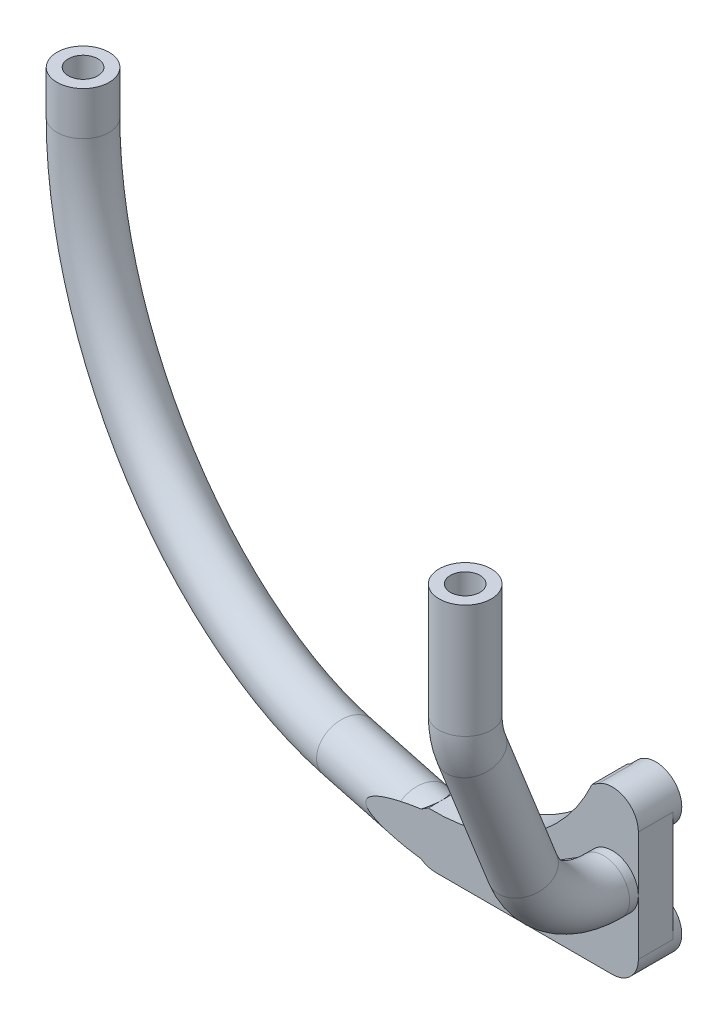
ISO-10303-21;
HEADER;
FILE_DESCRIPTION(('STEP AP214'),'2;1');
FILE_NAME('part.step','',(''),(''),'','','');
FILE_SCHEMA(('AUTOMOTIVE_DESIGN { 1 0 10303 214 1 1 1 1 }'));
ENDSEC;
DATA;
#1=APPLICATION_CONTEXT('core data for automotive mechanical design processes');
#2=APPLICATION_PROTOCOL_DEFINITION('international standard','automotive_design',2000,#1);
#3=PRODUCT_CONTEXT('',#1,'mechanical');
#4=PRODUCT('Part','Part','',(#3));
#5=PRODUCT_RELATED_PRODUCT_CATEGORY('part','',(#4));
#6=PRODUCT_DEFINITION_FORMATION('','',#4);
#7=PRODUCT_DEFINITION_CONTEXT('part definition',#1,'design');
#8=PRODUCT_DEFINITION('design','',#6,#7);
#9=PRODUCT_DEFINITION_SHAPE('','',#8);
#10=(LENGTH_UNIT() NAMED_UNIT(*) SI_UNIT(.MILLI.,.METRE.));
#11=(NAMED_UNIT(*) PLANE_ANGLE_UNIT() SI_UNIT($,.RADIAN.));
#12=(NAMED_UNIT(*) SI_UNIT($,.STERADIAN.) SOLID_ANGLE_UNIT());
#13=UNCERTAINTY_MEASURE_WITH_UNIT(LENGTH_MEASURE(1.E-05),#10,'distance_accuracy_value','');
#14=(GEOMETRIC_REPRESENTATION_CONTEXT(3) GLOBAL_UNCERTAINTY_ASSIGNED_CONTEXT((#13)) GLOBAL_UNIT_ASSIGNED_CONTEXT((#10,
#11,#12)) REPRESENTATION_CONTEXT('',''));
#15=CARTESIAN_POINT('',(0.,0.,0.));
#16=DIRECTION('',(0.,0.,1.));
#17=DIRECTION('',(1.,0.,0.));
#18=AXIS2_PLACEMENT_3D('',#15,#16,#17);
#19=CARTESIAN_POINT('',(0.,0.,1.));
#20=DIRECTION('',(0.,0.,1.));
#21=DIRECTION('',(1.,0.,0.));
#22=AXIS2_PLACEMENT_3D('',#19,#20,#21);
#23=PLANE('',#22);
#24=DIRECTION('',(0.847998304005092,0.529998940003174,0.));
#25=VECTOR('',#24,1.);
#26=CARTESIAN_POINT('',(-4.12999682000941,17.7839949120153,1.));
#27=LINE('',#26,#25);
#28=CARTESIAN_POINT('',(-24.4499968200095,5.08399491201543,1.));
#29=VERTEX_POINT('',#28);
#30=CARTESIAN_POINT('',(-23.7079590540112,5.54776851576436,1.));
#31=VERTEX_POINT('',#30);
#32=EDGE_CURVE('E297',#29,#31,#27,.T.);
#33=ORIENTED_EDGE('',*,*,#32,.T.);
#34=CARTESIAN_POINT('',(-23.105431544053,25.5386904704853,1.));
#35=DIRECTION('',(0.,0.,-1.));
#36=DIRECTION('',(-1.,0.,0.));
#37=AXIS2_PLACEMENT_3D('',#34,#35,#36);
#38=CIRCLE('',#37,20.);
#39=CARTESIAN_POINT('',(-22.8920128100939,5.53982919180257,1.));
#40=VERTEX_POINT('',#39);
#41=EDGE_CURVE('E56',#40,#31,#38,.T.);
#42=ORIENTED_EDGE('',*,*,#41,.F.);
#43=CARTESIAN_POINT('',(-22.86,2.54000000000016,1.));
#44=DIRECTION('',(0.,0.,1.));
#45=DIRECTION('',(1.,0.,0.));
#46=AXIS2_PLACEMENT_3D('',#43,#44,#45);
#47=CIRCLE('',#46,3.);
#48=EDGE_CURVE('E232',#29,#40,#47,.F.);
#49=ORIENTED_EDGE('',*,*,#48,.F.);
#50=EDGE_LOOP('',(#33,#42,#49));
#51=FACE_BOUND('',#50,.T.);
#52=ADVANCED_FACE('F41',(#51),#23,.F.);
#53=DIRECTION('',(-0.847998304005092,-0.529998940003174,0.));
#54=VECTOR('',#53,1.);
#55=CARTESIAN_POINT('',(-0.950003179990373,12.6960050879847,1.));
#56=LINE('',#55,#54);
#57=CARTESIAN_POINT('',(-5.53999999999989,9.82725707547884,1.));
#58=VERTEX_POINT('',#57);
#59=CARTESIAN_POINT('',(-12.3996113207659,5.54000000000016,1.));
#60=VERTEX_POINT('',#59);
#61=EDGE_CURVE('E199',#58,#60,#56,.T.);
#62=ORIENTED_EDGE('',*,*,#61,.T.);
#63=DIRECTION('',(-1.,0.,0.));
#64=VECTOR('',#63,1.);
#65=CARTESIAN_POINT('',(-22.86,5.54000000000016,1.));
#66=LINE('',#65,#64);
#67=CARTESIAN_POINT('',(-5.5399999999999,5.54000000000016,1.));
#68=VERTEX_POINT('',#67);
#69=EDGE_CURVE('E213',#68,#60,#66,.T.);
#70=ORIENTED_EDGE('',*,*,#69,.F.);
#71=DIRECTION('',(0.,-1.,0.));
#72=VECTOR('',#71,1.);
#73=CARTESIAN_POINT('',(-5.5399999999999,2.54000000000017,1.));
#74=LINE('',#73,#72);
#75=EDGE_CURVE('E256',#58,#68,#74,.T.);
#76=ORIENTED_EDGE('',*,*,#75,.F.);
#77=EDGE_LOOP('',(#62,#70,#76));
#78=FACE_BOUND('',#77,.T.);
#79=CARTESIAN_POINT('',(-22.86,-0.459999999999835,1.));
#80=VERTEX_POINT('',#79);
#81=EDGE_CURVE('E229',#40,#80,#47,.F.);
#82=ORIENTED_EDGE('',*,*,#81,.F.);
#83=CARTESIAN_POINT('',(-5.22244759270248,16.583307452672,1.));
#84=VERTEX_POINT('',#83);
#85=EDGE_CURVE('E355',#84,#40,#38,.T.);
#86=ORIENTED_EDGE('',*,*,#85,.F.);
#87=CARTESIAN_POINT('',(-2.53999999999989,15.24,1.));
#88=DIRECTION('',(0.,0.,1.));
#89=DIRECTION('',(1.,0.,0.));
#90=AXIS2_PLACEMENT_3D('',#87,#88,#89);
#91=CIRCLE('',#90,3.);
#92=CARTESIAN_POINT('',(0.460000000000107,15.24,1.));
#93=VERTEX_POINT('',#92);
#94=EDGE_CURVE('E275',#84,#93,#91,.T.);
#95=ORIENTED_EDGE('',*,*,#94,.T.);
#96=DIRECTION('',(0.,1.,0.));
#97=VECTOR('',#96,1.);
#98=CARTESIAN_POINT('',(0.460000000000105,2.54000000000016,1.));
#99=LINE('',#98,#97);
#100=CARTESIAN_POINT('',(0.460000000000107,2.54000000000016,1.));
#101=VERTEX_POINT('',#100);
#102=EDGE_CURVE('E258',#101,#93,#99,.T.);
#103=ORIENTED_EDGE('',*,*,#102,.F.);
#104=CARTESIAN_POINT('',(-2.53999999999989,2.54000000000016,1.));
#105=DIRECTION('',(0.,0.,1.));
#106=DIRECTION('',(1.,0.,0.));
#107=AXIS2_PLACEMENT_3D('',#104,#105,#106);
#108=CIRCLE('',#107,3.);
#109=CARTESIAN_POINT('',(-2.53999999999989,-0.459999999999836,1.));
#110=VERTEX_POINT('',#109);
#111=EDGE_CURVE('E281',#110,#101,#108,.F.);
#112=ORIENTED_EDGE('',*,*,#111,.F.);
#113=DIRECTION('',(1.,0.,0.));
#114=VECTOR('',#113,1.);
#115=CARTESIAN_POINT('',(-22.86,-0.459999999999836,1.));
#116=LINE('',#115,#114);
#117=EDGE_CURVE('E210',#80,#110,#116,.T.);
#118=ORIENTED_EDGE('',*,*,#117,.F.);
#119=EDGE_LOOP('',(#82,#86,#95,#103,#112,#118));
#120=FACE_BOUND('',#119,.T.);
#121=ADVANCED_FACE('F359',(#78,#120),#23,.F.);
#122=CARTESIAN_POINT('',(-4.12999682000941,17.7839949120153,-28.4730772580799));
#123=DIRECTION('',(-0.529998940003174,0.847998304005092,0.));
#124=DIRECTION('',(-0.847998304005092,-0.529998940003174,0.));
#125=AXIS2_PLACEMENT_3D('',#122,#123,#124);
#126=PLANE('',#125);
#127=DIRECTION('',(0.,0.,-1.));
#128=VECTOR('',#127,1.);
#129=CARTESIAN_POINT('',(-4.87203458600771,17.3202213082664,27.2170321925751));
#130=LINE('',#129,#128);
#131=CARTESIAN_POINT('',(-4.87203458600771,17.3202213082664,5.));
#132=VERTEX_POINT('',#131);
#133=CARTESIAN_POINT('',(-4.87203458600771,17.3202213082664,1.));
#134=VERTEX_POINT('',#133);
#135=EDGE_CURVE('E163',#132,#134,#130,.T.);
#136=ORIENTED_EDGE('',*,*,#135,.F.);
#137=DIRECTION('',(-0.847998304005092,-0.529998940003174,0.));
#138=VECTOR('',#137,1.);
#139=CARTESIAN_POINT('',(-4.12999682000941,17.7839949120153,5.));
#140=LINE('',#139,#138);
#141=CARTESIAN_POINT('',(-4.12999682000942,17.7839949120153,5.));
#142=VERTEX_POINT('',#141);
#143=EDGE_CURVE('E175',#142,#132,#140,.T.);
#144=ORIENTED_EDGE('',*,*,#143,.F.);
#145=DIRECTION('',(0.,0.,1.));
#146=VECTOR('',#145,1.);
#147=CARTESIAN_POINT('',(-4.12999682000941,17.7839949120153,-28.4730772580799));
#148=LINE('',#147,#146);
#149=CARTESIAN_POINT('',(-4.12999682000942,17.7839949120153,1.));
#150=VERTEX_POINT('',#149);
#151=EDGE_CURVE('E183',#150,#142,#148,.T.);
#152=ORIENTED_EDGE('',*,*,#151,.F.);
#153=EDGE_CURVE('E176',#134,#150,#27,.T.);
#154=ORIENTED_EDGE('',*,*,#153,.F.);
#155=EDGE_LOOP('',(#136,#144,#152,#154));
#156=FACE_BOUND('',#155,.T.);
#157=ADVANCED_FACE('F173',(#156),#126,.T.);
#158=CARTESIAN_POINT('',(-11.7875799398197,2.53999999999996,5.96526414957655));
#159=DIRECTION('',(-0.978512631178777,0.,-0.206186882763154));
#160=DIRECTION('',(-0.206186882763154,0.,0.978512631178777));
#161=AXIS2_PLACEMENT_3D('',#158,#159,#160);
#162=CYLINDRICAL_SURFACE('',#161,3.00000000000001);
#163=CARTESIAN_POINT('',(-26.4652694075013,2.53999999999994,2.87246090812925));
#164=DIRECTION('',(0.978512631178777,0.,0.206186882763154));
#165=DIRECTION('',(0.0425130306235854,0.978512631178777,-0.201756469167124));
#166=AXIS2_PLACEMENT_3D('',#163,#164,#165);
#167=CIRCLE('',#166,3.00000000000001);
#168=CARTESIAN_POINT('',(-26.9135729238097,0.472972818314274,5.));
#169=VERTEX_POINT('',#168);
#170=CARTESIAN_POINT('',(-26.9135729238097,4.60702718168562,5.));
#171=VERTEX_POINT('',#170);
#172=EDGE_CURVE('E321',#169,#171,#167,.T.);
#173=ORIENTED_EDGE('',*,*,#172,.T.);
#174=CARTESIAN_POINT('',(-16.3684880467125,2.53999999999995,5.));
#175=DIRECTION('',(0.,0.,-1.));
#176=DIRECTION('',(-1.,0.,0.));
#177=AXIS2_PLACEMENT_3D('',#174,#175,#176);
#178=ELLIPSE('',#177,14.5499071512037,3.00000000000001);
#179=CARTESIAN_POINT('',(-24.5461205553356,5.02132977914555,5.));
#180=VERTEX_POINT('',#179);
#181=EDGE_CURVE('E294',#171,#180,#178,.T.);
#182=ORIENTED_EDGE('',*,*,#181,.T.);
#183=CARTESIAN_POINT('',(-22.86,2.54000000000005,3.63214375428584));
#184=DIRECTION('',(-0.630005205231213,0.,-0.776590909927213));
#185=DIRECTION('',(0.776590909927213,0.,-0.630005205231213));
#186=AXIS2_PLACEMENT_3D('',#183,#184,#185);
#187=ELLIPSE('',#186,3.86303774825433,3.);
#188=CARTESIAN_POINT('',(-24.4499968200095,5.08399491201543,4.92202013591989));
#189=VERTEX_POINT('',#188);
#190=EDGE_CURVE('E64',#180,#189,#187,.T.);
#191=ORIENTED_EDGE('',*,*,#190,.T.);
#192=CARTESIAN_POINT('',(-28.5203886792344,2.53999999999994,2.43941730414976));
#193=DIRECTION('',(-0.529998940003174,0.847998304005092,0.));
#194=DIRECTION('',(-0.822971785263757,-0.51435736578984,-0.241151282222431));
#195=AXIS2_PLACEMENT_3D('',#192,#193,#194);
#196=ELLIPSE('',#195,5.78468636875458,3.00000000000001);
#197=CARTESIAN_POINT('',(-24.4499968200095,5.08399491201543,1.67219633324953));
#198=VERTEX_POINT('',#197);
#199=EDGE_CURVE('E49',#198,#189,#196,.F.);
#200=ORIENTED_EDGE('',*,*,#199,.F.);
#201=CARTESIAN_POINT('',(-22.86,2.54000000000005,3.63214375428584));
#202=DIRECTION('',(0.776590909927213,0.,-0.630005205231213));
#203=DIRECTION('',(-0.630005205231213,0.,-0.776590909927213));
#204=AXIS2_PLACEMENT_3D('',#201,#202,#203);
#205=ELLIPSE('',#204,4.76186541807856,3.);
#206=CARTESIAN_POINT('',(-25.8065571153319,3.10373856182361,0.));
#207=VERTEX_POINT('',#206);
#208=EDGE_CURVE('E309',#198,#207,#205,.F.);
#209=ORIENTED_EDGE('',*,*,#208,.T.);
#210=CARTESIAN_POINT('',(-40.0972679299312,2.53999999999993,0.));
#211=DIRECTION('',(0.,0.,1.));
#212=DIRECTION('',(-1.,0.,0.));
#213=AXIS2_PLACEMENT_3D('',#210,#211,#212);
#214=ELLIPSE('',#213,14.5499071512037,3.00000000000001);
#215=CARTESIAN_POINT('',(-25.8065571153319,1.97626143817644,0.));
#216=VERTEX_POINT('',#215);
#217=EDGE_CURVE('E305',#207,#216,#214,.F.);
#218=ORIENTED_EDGE('',*,*,#217,.T.);
#219=CARTESIAN_POINT('',(-22.86,-0.459999999999948,3.63214375428584));
#220=VERTEX_POINT('',#219);
#221=EDGE_CURVE('E307',#216,#220,#205,.F.);
#222=ORIENTED_EDGE('',*,*,#221,.T.);
#223=CARTESIAN_POINT('',(-24.5461205553356,0.0586702208543986,5.));
#224=VERTEX_POINT('',#223);
#225=EDGE_CURVE('E310',#220,#224,#187,.T.);
#226=ORIENTED_EDGE('',*,*,#225,.T.);
#227=EDGE_CURVE('E323',#224,#169,#178,.T.);
#228=ORIENTED_EDGE('',*,*,#227,.T.);
#229=EDGE_LOOP('',(#173,#182,#191,#200,#209,#218,#222,#226,#228));
#230=FACE_BOUND('',#229,.T.);
#231=ADVANCED_FACE('F386',(#230),#162,.T.);
#232=CARTESIAN_POINT('',(-22.86,2.54000000000016,5.));
#233=DIRECTION('',(0.,0.,-1.));
#234=DIRECTION('',(-1.,0.,0.));
#235=AXIS2_PLACEMENT_3D('',#232,#233,#234);
#236=CYLINDRICAL_SURFACE('',#235,3.);
#237=ORIENTED_EDGE('',*,*,#190,.F.);
#238=CARTESIAN_POINT('',(-22.86,2.54000000000016,5.));
#239=DIRECTION('',(0.,0.,1.));
#240=DIRECTION('',(1.,0.,0.));
#241=AXIS2_PLACEMENT_3D('',#238,#239,#240);
#242=CIRCLE('',#241,3.);
#243=CARTESIAN_POINT('',(-24.4499968200095,5.08399491201544,5.));
#244=VERTEX_POINT('',#243);
#245=EDGE_CURVE('E207',#244,#180,#242,.T.);
#246=ORIENTED_EDGE('',*,*,#245,.F.);
#247=DIRECTION('',(0.,0.,1.));
#248=VECTOR('',#247,1.);
#249=CARTESIAN_POINT('',(-24.4499968200095,5.08399491201543,-28.4730772580799));
#250=LINE('',#249,#248);
#251=EDGE_CURVE('E186',#189,#244,#250,.T.);
#252=ORIENTED_EDGE('',*,*,#251,.F.);
#253=EDGE_LOOP('',(#237,#246,#252));
#254=FACE_BOUND('',#253,.T.);
#255=ADVANCED_FACE('F292',(#254),#236,.T.);
#256=ORIENTED_EDGE('',*,*,#208,.F.);
#257=EDGE_CURVE('E192',#29,#198,#250,.T.);
#258=ORIENTED_EDGE('',*,*,#257,.F.);
#259=ORIENTED_EDGE('',*,*,#48,.T.);
#260=ORIENTED_EDGE('',*,*,#81,.T.);
#261=DIRECTION('',(0.,0.,1.));
#262=VECTOR('',#261,1.);
#263=CARTESIAN_POINT('',(-22.86,-0.459999999999836,1.));
#264=LINE('',#263,#262);
#265=EDGE_CURVE('E223',#80,#220,#264,.T.);
#266=ORIENTED_EDGE('',*,*,#265,.T.);
#267=ORIENTED_EDGE('',*,*,#221,.F.);
#268=CARTESIAN_POINT('',(-22.86,2.54000000000016,0.));
#269=DIRECTION('',(0.,0.,1.));
#270=DIRECTION('',(1.,0.,0.));
#271=AXIS2_PLACEMENT_3D('',#268,#269,#270);
#272=CIRCLE('',#271,3.);
#273=EDGE_CURVE('E203',#216,#207,#272,.T.);
#274=ORIENTED_EDGE('',*,*,#273,.T.);
#275=EDGE_LOOP('',(#256,#258,#259,#260,#266,#267,#274));
#276=FACE_BOUND('',#275,.T.);
#277=ADVANCED_FACE('F375',(#276),#236,.T.);
#278=ORIENTED_EDGE('',*,*,#225,.F.);
#279=CARTESIAN_POINT('',(-22.86,-0.459999999999836,5.));
#280=VERTEX_POINT('',#279);
#281=EDGE_CURVE('E216',#220,#280,#264,.T.);
#282=ORIENTED_EDGE('',*,*,#281,.T.);
#283=EDGE_CURVE('E202',#224,#280,#242,.T.);
#284=ORIENTED_EDGE('',*,*,#283,.F.);
#285=EDGE_LOOP('',(#278,#282,#284));
#286=FACE_BOUND('',#285,.T.);
#287=ADVANCED_FACE('F368',(#286),#236,.T.);
#288=EDGE_CURVE('E278',#150,#84,#91,.T.);
#289=ORIENTED_EDGE('',*,*,#288,.T.);
#290=EDGE_CURVE('E177',#134,#84,#38,.T.);
#291=ORIENTED_EDGE('',*,*,#290,.F.);
#292=ORIENTED_EDGE('',*,*,#153,.T.);
#293=EDGE_LOOP('',(#289,#291,#292));
#294=FACE_BOUND('',#293,.T.);
#295=ADVANCED_FACE('F366',(#294),#23,.F.);
#296=CARTESIAN_POINT('',(-2.53999999999989,15.24,5.));
#297=DIRECTION('',(0.,0.,-1.));
#298=DIRECTION('',(-1.,0.,0.));
#299=AXIS2_PLACEMENT_3D('',#296,#297,#298);
#300=CYLINDRICAL_SURFACE('',#299,3.);
#301=CARTESIAN_POINT('',(-2.53999999999989,15.24,0.));
#302=DIRECTION('',(0.,0.,1.));
#303=DIRECTION('',(1.,0.,0.));
#304=AXIS2_PLACEMENT_3D('',#301,#302,#303);
#305=CIRCLE('',#304,3.);
#306=CARTESIAN_POINT('',(0.460000000000107,15.24,0.));
#307=VERTEX_POINT('',#306);
#308=EDGE_CURVE('E262',#307,#307,#305,.T.);
#309=ORIENTED_EDGE('',*,*,#308,.T.);
#310=EDGE_LOOP('',(#309));
#311=FACE_BOUND('',#310,.T.);
#312=ORIENTED_EDGE('',*,*,#288,.F.);
#313=ORIENTED_EDGE('',*,*,#151,.T.);
#314=CARTESIAN_POINT('',(-2.53999999999989,15.24,5.));
#315=DIRECTION('',(0.,0.,1.));
#316=DIRECTION('',(1.,0.,0.));
#317=AXIS2_PLACEMENT_3D('',#314,#315,#316);
#318=CIRCLE('',#317,3.);
#319=CARTESIAN_POINT('',(0.460000000000107,15.24,5.));
#320=VERTEX_POINT('',#319);
#321=EDGE_CURVE('E182',#320,#142,#318,.T.);
#322=ORIENTED_EDGE('',*,*,#321,.F.);
#323=DIRECTION('',(0.,0.,1.));
#324=VECTOR('',#323,1.);
#325=CARTESIAN_POINT('',(0.460000000000107,15.24,-13.0459958707098));
#326=LINE('',#325,#324);
#327=EDGE_CURVE('E269',#93,#320,#326,.T.);
#328=ORIENTED_EDGE('',*,*,#327,.F.);
#329=ORIENTED_EDGE('',*,*,#94,.F.);
#330=EDGE_LOOP('',(#312,#313,#322,#328,#329));
#331=FACE_BOUND('',#330,.T.);
#332=ADVANCED_FACE('F43',(#311,#331),#300,.T.);
#333=CARTESIAN_POINT('',(-2.53999999999989,15.24,5.));
#334=DIRECTION('',(0.,0.,1.));
#335=DIRECTION('',(1.,0.,0.));
#336=AXIS2_PLACEMENT_3D('',#333,#334,#335);
#337=PLANE('',#336);
#338=CARTESIAN_POINT('',(-23.105431544053,25.5386904704853,5.));
#339=DIRECTION('',(0.,0.,1.));
#340=DIRECTION('',(1.,0.,0.));
#341=AXIS2_PLACEMENT_3D('',#338,#339,#340);
#342=CIRCLE('',#341,20.);
#343=CARTESIAN_POINT('',(-23.7079590540112,5.54776851576436,5.));
#344=VERTEX_POINT('',#343);
#345=EDGE_CURVE('E160',#132,#344,#342,.F.);
#346=ORIENTED_EDGE('',*,*,#345,.T.);
#347=EDGE_CURVE('E184',#344,#244,#140,.T.);
#348=ORIENTED_EDGE('',*,*,#347,.T.);
#349=ORIENTED_EDGE('',*,*,#245,.T.);
#350=ORIENTED_EDGE('',*,*,#181,.F.);
#351=CARTESIAN_POINT('',(-16.3684880467125,2.53999999999993,5.));
#352=DIRECTION('',(0.,0.,-1.));
#353=DIRECTION('',(-1.,0.,0.));
#354=AXIS2_PLACEMENT_3D('',#351,#352,#353);
#355=ELLIPSE('',#354,14.5499071512037,3.00000000000001);
#356=EDGE_CURVE('E12',#169,#171,#355,.T.);
#357=ORIENTED_EDGE('',*,*,#356,.F.);
#358=ORIENTED_EDGE('',*,*,#227,.F.);
#359=ORIENTED_EDGE('',*,*,#283,.T.);
#360=DIRECTION('',(1.,0.,0.));
#361=VECTOR('',#360,1.);
#362=CARTESIAN_POINT('',(-22.86,-0.459999999999836,5.));
#363=LINE('',#362,#361);
#364=CARTESIAN_POINT('',(-2.53999999999989,-0.459999999999836,5.));
#365=VERTEX_POINT('',#364);
#366=EDGE_CURVE('E206',#280,#365,#363,.T.);
#367=ORIENTED_EDGE('',*,*,#366,.T.);
#368=CARTESIAN_POINT('',(-2.53999999999989,2.54000000000016,5.));
#369=DIRECTION('',(0.,0.,1.));
#370=DIRECTION('',(-1.,0.,0.));
#371=AXIS2_PLACEMENT_3D('',#368,#369,#370);
#372=CIRCLE('',#371,3.);
#373=CARTESIAN_POINT('',(0.460000000000105,2.54000000000017,5.));
#374=VERTEX_POINT('',#373);
#375=EDGE_CURVE('E222',#365,#374,#372,.T.);
#376=ORIENTED_EDGE('',*,*,#375,.T.);
#377=DIRECTION('',(0.,-1.,0.));
#378=VECTOR('',#377,1.);
#379=CARTESIAN_POINT('',(0.460000000000105,2.54000000000016,5.));
#380=LINE('',#379,#378);
#381=CARTESIAN_POINT('',(0.460000000000108,8.89000000000009,5.));
#382=VERTEX_POINT('',#381);
#383=EDGE_CURVE('E255',#382,#374,#380,.T.);
#384=ORIENTED_EDGE('',*,*,#383,.F.);
#385=CARTESIAN_POINT('',(-2.53999999999989,8.89000000000009,5.));
#386=DIRECTION('',(0.,0.,1.));
#387=DIRECTION('',(1.,0.,0.));
#388=AXIS2_PLACEMENT_3D('',#385,#386,#387);
#389=CIRCLE('',#388,3.);
#390=CARTESIAN_POINT('',(-5.53999999999989,8.89000000000009,5.));
#391=VERTEX_POINT('',#390);
#392=EDGE_CURVE('E240',#391,#382,#389,.T.);
#393=ORIENTED_EDGE('',*,*,#392,.F.);
#394=DIRECTION('',(0.,1.,0.));
#395=VECTOR('',#394,1.);
#396=CARTESIAN_POINT('',(-5.5399999999999,2.54000000000017,5.));
#397=LINE('',#396,#395);
#398=CARTESIAN_POINT('',(-5.5399999999999,5.54000000000016,5.));
#399=VERTEX_POINT('',#398);
#400=EDGE_CURVE('E266',#399,#391,#397,.T.);
#401=ORIENTED_EDGE('',*,*,#400,.F.);
#402=DIRECTION('',(-1.,0.,0.));
#403=VECTOR('',#402,1.);
#404=CARTESIAN_POINT('',(-22.86,5.54000000000016,5.));
#405=LINE('',#404,#403);
#406=CARTESIAN_POINT('',(-12.3996113207659,5.54000000000016,5.));
#407=VERTEX_POINT('',#406);
#408=EDGE_CURVE('E214',#399,#407,#405,.T.);
#409=ORIENTED_EDGE('',*,*,#408,.T.);
#410=DIRECTION('',(0.847998304005092,0.529998940003174,0.));
#411=VECTOR('',#410,1.);
#412=CARTESIAN_POINT('',(-0.950003179990373,12.6960050879847,5.));
#413=LINE('',#412,#411);
#414=CARTESIAN_POINT('',(-5.53999999999989,9.82725707547884,5.));
#415=VERTEX_POINT('',#414);
#416=EDGE_CURVE('E188',#407,#415,#413,.T.);
#417=ORIENTED_EDGE('',*,*,#416,.T.);
#418=EDGE_CURVE('E265',#391,#415,#397,.T.);
#419=ORIENTED_EDGE('',*,*,#418,.F.);
#420=EDGE_CURVE('E237',#382,#391,#389,.T.);
#421=ORIENTED_EDGE('',*,*,#420,.F.);
#422=EDGE_CURVE('E263',#320,#382,#380,.T.);
#423=ORIENTED_EDGE('',*,*,#422,.F.);
#424=ORIENTED_EDGE('',*,*,#321,.T.);
#425=ORIENTED_EDGE('',*,*,#143,.T.);
#426=EDGE_LOOP('',(#346,#348,#349,#350,#357,#358,#359,#367,#376,#384,#393,#401,#409,#417,#419,
#421,#423,#424,#425));
#427=FACE_BOUND('',#426,.T.);
#428=ADVANCED_FACE('F180',(#427),#337,.T.);
#429=CARTESIAN_POINT('',(-2.53999999999989,15.24,0.));
#430=DIRECTION('',(0.,0.,1.));
#431=DIRECTION('',(1.,0.,0.));
#432=AXIS2_PLACEMENT_3D('',#429,#430,#431);
#433=PLANE('',#432);
#434=CARTESIAN_POINT('',(-2.53999999999989,15.24,0.));
#435=DIRECTION('',(0.,0.,-1.));
#436=DIRECTION('',(1.,0.,0.));
#437=AXIS2_PLACEMENT_3D('',#434,#435,#436);
#438=CIRCLE('',#437,1.7);
#439=CARTESIAN_POINT('',(-0.839999999999896,15.24,0.));
#440=VERTEX_POINT('',#439);
#441=EDGE_CURVE('E342',#440,#440,#438,.T.);
#442=ORIENTED_EDGE('',*,*,#441,.F.);
#443=EDGE_LOOP('',(#442));
#444=FACE_BOUND('',#443,.T.);
#445=ORIENTED_EDGE('',*,*,#308,.F.);
#446=EDGE_LOOP('',(#445));
#447=FACE_BOUND('',#446,.T.);
#448=ADVANCED_FACE('F566',(#444,#447),#433,.F.);
#449=CARTESIAN_POINT('',(-5.5399999999999,2.54000000000017,-13.0459958707098));
#450=DIRECTION('',(1.,0.,0.));
#451=DIRECTION('',(0.,1.,0.));
#452=AXIS2_PLACEMENT_3D('',#449,#450,#451);
#453=PLANE('',#452);
#454=ORIENTED_EDGE('',*,*,#418,.T.);
#455=DIRECTION('',(0.,0.,-1.));
#456=VECTOR('',#455,1.);
#457=CARTESIAN_POINT('',(-5.53999999999989,9.82725707547884,-13.0459958707098));
#458=LINE('',#457,#456);
#459=EDGE_CURVE('E198',#415,#58,#458,.T.);
#460=ORIENTED_EDGE('',*,*,#459,.T.);
#461=ORIENTED_EDGE('',*,*,#75,.T.);
#462=DIRECTION('',(0.,0.,1.));
#463=VECTOR('',#462,1.);
#464=CARTESIAN_POINT('',(-5.5399999999999,5.54000000000016,-13.0459958707098));
#465=LINE('',#464,#463);
#466=EDGE_CURVE('E235',#68,#399,#465,.T.);
#467=ORIENTED_EDGE('',*,*,#466,.T.);
#468=ORIENTED_EDGE('',*,*,#400,.T.);
#469=EDGE_LOOP('',(#454,#460,#461,#467,#468));
#470=FACE_BOUND('',#469,.T.);
#471=ADVANCED_FACE('F402',(#470),#453,.F.);
#472=CARTESIAN_POINT('',(0.460000000000105,2.54000000000016,-13.0459958707098));
#473=DIRECTION('',(-1.,0.,0.));
#474=DIRECTION('',(0.,-1.,0.));
#475=AXIS2_PLACEMENT_3D('',#472,#473,#474);
#476=PLANE('',#475);
#477=DIRECTION('',(0.,0.,1.));
#478=VECTOR('',#477,1.);
#479=CARTESIAN_POINT('',(0.460000000000105,2.54000000000017,-13.0459958707098));
#480=LINE('',#479,#478);
#481=EDGE_CURVE('E259',#101,#374,#480,.T.);
#482=ORIENTED_EDGE('',*,*,#481,.F.);
#483=ORIENTED_EDGE('',*,*,#102,.T.);
#484=ORIENTED_EDGE('',*,*,#327,.T.);
#485=ORIENTED_EDGE('',*,*,#422,.T.);
#486=ORIENTED_EDGE('',*,*,#383,.T.);
#487=EDGE_LOOP('',(#482,#483,#484,#485,#486));
#488=FACE_BOUND('',#487,.T.);
#489=ADVANCED_FACE('F489',(#488),#476,.F.);
#490=CARTESIAN_POINT('',(-2.53999999999989,46.9387395096274,21.9299999999999));
#491=DIRECTION('',(0.,1.,0.));
#492=DIRECTION('',(1.,0.,0.));
#493=AXIS2_PLACEMENT_3D('',#490,#491,#492);
#494=PLANE('',#493);
#495=CARTESIAN_POINT('',(-2.53999999999989,46.9387395096274,21.9300000000007));
#496=DIRECTION('',(0.,1.,0.));
#497=DIRECTION('',(0.,0.,1.));
#498=AXIS2_PLACEMENT_3D('',#495,#496,#497);
#499=CIRCLE('',#498,1.7);
#500=CARTESIAN_POINT('',(-2.53999999999989,46.9387395096274,23.6300000000007));
#501=VERTEX_POINT('',#500);
#502=EDGE_CURVE('E334',#501,#501,#499,.T.);
#503=ORIENTED_EDGE('',*,*,#502,.F.);
#504=EDGE_LOOP('',(#503));
#505=FACE_BOUND('',#504,.T.);
#506=CARTESIAN_POINT('',(-2.53999999999989,46.9387395096274,21.9299999999999));
#507=DIRECTION('',(0.,1.,0.));
#508=DIRECTION('',(1.,0.,0.));
#509=AXIS2_PLACEMENT_3D('',#506,#507,#508);
#510=CIRCLE('',#509,3.);
#511=CARTESIAN_POINT('',(0.460000000000108,46.9387395096274,21.9299999999999));
#512=VERTEX_POINT('',#511);
#513=EDGE_CURVE('E252',#512,#512,#510,.T.);
#514=ORIENTED_EDGE('',*,*,#513,.T.);
#515=EDGE_LOOP('',(#514));
#516=FACE_BOUND('',#515,.T.);
#517=ADVANCED_FACE('F467',(#505,#516),#494,.T.);
#518=CARTESIAN_POINT('',(-2.53999999999989,8.89000000000009,5.));
#519=DIRECTION('',(0.,0.,1.));
#520=DIRECTION('',(1.,0.,0.));
#521=AXIS2_PLACEMENT_3D('',#518,#519,#520);
#522=CYLINDRICAL_SURFACE('',#521,3.);
#523=CARTESIAN_POINT('',(-2.53999999999989,8.89000000000009,6.));
#524=DIRECTION('',(0.,0.,1.));
#525=DIRECTION('',(1.,0.,0.));
#526=AXIS2_PLACEMENT_3D('',#523,#524,#525);
#527=CIRCLE('',#526,3.);
#528=CARTESIAN_POINT('',(-2.53999999999989,5.89000000000009,6.));
#529=VERTEX_POINT('',#528);
#530=EDGE_CURVE('E239',#529,#529,#527,.T.);
#531=ORIENTED_EDGE('',*,*,#530,.F.);
#532=EDGE_LOOP('',(#531));
#533=FACE_BOUND('',#532,.T.);
#534=ORIENTED_EDGE('',*,*,#420,.T.);
#535=ORIENTED_EDGE('',*,*,#392,.T.);
#536=EDGE_LOOP('',(#534,#535));
#537=FACE_BOUND('',#536,.T.);
#538=ADVANCED_FACE('F471',(#533,#537),#522,.T.);
#539=CARTESIAN_POINT('',(-2.53999999999989,18.8900000000001,6.));
#540=DIRECTION('',(-1.,0.,0.));
#541=DIRECTION('',(0.,0.,1.));
#542=AXIS2_PLACEMENT_3D('',#539,#540,#541);
#543=TOROIDAL_SURFACE('',#542,9.99999999999999,3.);
#544=CARTESIAN_POINT('',(-2.53999999999989,15.2047368680218,15.2961731722296));
#545=DIRECTION('',(0.,0.929617317222961,0.368526313197829));
#546=DIRECTION('',(1.,0.,0.));
#547=AXIS2_PLACEMENT_3D('',#544,#545,#546);
#548=CIRCLE('',#547,3.);
#549=CARTESIAN_POINT('',(-2.53999999999989,14.0991579284283,18.0850251238985));
#550=VERTEX_POINT('',#549);
#551=EDGE_CURVE('E243',#550,#550,#548,.T.);
#552=CARTESIAN_POINT('',(-2.53999999999989,18.8900000000001,6.));
#553=DIRECTION('',(-1.,0.,0.));
#554=DIRECTION('',(0.,0.,1.));
#555=AXIS2_PLACEMENT_3D('',#552,#553,#554);
#556=CIRCLE('',#555,13.);
#557=EDGE_CURVE('',#529,#550,#556,.T.);
#558=ORIENTED_EDGE('',*,*,#530,.T.);
#559=ORIENTED_EDGE('',*,*,#551,.F.);
#560=ORIENTED_EDGE('',*,*,#557,.T.);
#561=ORIENTED_EDGE('',*,*,#557,.F.);
#562=EDGE_LOOP('',(#558,#560,#559,#561));
#563=FACE_BOUND('',#562,.T.);
#564=ADVANCED_FACE('F474',(#563),#543,.T.);
#565=CARTESIAN_POINT('',(-2.53999999999989,15.2047368680218,15.2961731722296));
#566=DIRECTION('',(0.,0.929617317222961,0.368526313197829));
#567=DIRECTION('',(0.,-0.368526313197829,0.929617317222961));
#568=AXIS2_PLACEMENT_3D('',#565,#566,#567);
#569=CYLINDRICAL_SURFACE('',#568,3.);
#570=CARTESIAN_POINT('',(-2.53999999999989,30.1633178260466,21.2261731722296));
#571=DIRECTION('',(0.,0.929617317222961,0.368526313197829));
#572=DIRECTION('',(1.,0.,0.));
#573=AXIS2_PLACEMENT_3D('',#570,#571,#572);
#574=CIRCLE('',#573,3.);
#575=CARTESIAN_POINT('',(-2.53999999999989,29.057738886453,24.0150251238984));
#576=VERTEX_POINT('',#575);
#577=EDGE_CURVE('E246',#576,#576,#574,.T.);
#578=ORIENTED_EDGE('',*,*,#577,.F.);
#579=EDGE_LOOP('',(#578));
#580=FACE_BOUND('',#579,.T.);
#581=ORIENTED_EDGE('',*,*,#551,.T.);
#582=EDGE_LOOP('',(#581));
#583=FACE_BOUND('',#582,.T.);
#584=ADVANCED_FACE('F478',(#580,#583),#569,.T.);
#585=CARTESIAN_POINT('',(-2.53999999999989,33.8485809580251,11.9299999999999));
#586=DIRECTION('',(-1.,0.,0.));
#587=DIRECTION('',(0.,0.,1.));
#588=AXIS2_PLACEMENT_3D('',#585,#586,#587);
#589=TOROIDAL_SURFACE('',#588,10.,3.);
#590=CARTESIAN_POINT('',(-2.53999999999989,33.8485809580249,21.93));
#591=DIRECTION('',(0.,1.,0.));
#592=DIRECTION('',(1.,0.,0.));
#593=AXIS2_PLACEMENT_3D('',#590,#591,#592);
#594=CIRCLE('',#593,3.);
#595=CARTESIAN_POINT('',(-2.53999999999989,33.8485809580248,24.93));
#596=VERTEX_POINT('',#595);
#597=EDGE_CURVE('E249',#596,#596,#594,.T.);
#598=CARTESIAN_POINT('',(-2.53999999999989,33.8485809580251,11.9299999999999));
#599=DIRECTION('',(-1.,0.,0.));
#600=DIRECTION('',(0.,0.,1.));
#601=AXIS2_PLACEMENT_3D('',#598,#599,#600);
#602=CIRCLE('',#601,13.);
#603=EDGE_CURVE('',#576,#596,#602,.T.);
#604=ORIENTED_EDGE('',*,*,#577,.T.);
#605=ORIENTED_EDGE('',*,*,#597,.F.);
#606=ORIENTED_EDGE('',*,*,#603,.T.);
#607=ORIENTED_EDGE('',*,*,#603,.F.);
#608=EDGE_LOOP('',(#604,#606,#605,#607));
#609=FACE_BOUND('',#608,.T.);
#610=ADVANCED_FACE('F482',(#609),#589,.T.);
#611=CARTESIAN_POINT('',(-2.53999999999989,33.8485809580249,21.9299999999999));
#612=DIRECTION('',(0.,1.,0.));
#613=DIRECTION('',(0.,0.,1.));
#614=AXIS2_PLACEMENT_3D('',#611,#612,#613);
#615=CYLINDRICAL_SURFACE('',#614,3.);
#616=ORIENTED_EDGE('',*,*,#513,.F.);
#617=EDGE_LOOP('',(#616));
#618=FACE_BOUND('',#617,.T.);
#619=ORIENTED_EDGE('',*,*,#597,.T.);
#620=EDGE_LOOP('',(#619));
#621=FACE_BOUND('',#620,.T.);
#622=ADVANCED_FACE('F465',(#618,#621),#615,.T.);
#623=CARTESIAN_POINT('',(-2.53999999999989,2.54000000000016,5.));
#624=DIRECTION('',(0.,0.,-1.));
#625=DIRECTION('',(-1.,0.,0.));
#626=AXIS2_PLACEMENT_3D('',#623,#624,#625);
#627=CYLINDRICAL_SURFACE('',#626,3.);
#628=CARTESIAN_POINT('',(-2.53999999999989,2.54000000000016,0.));
#629=DIRECTION('',(0.,0.,1.));
#630=DIRECTION('',(-1.,0.,0.));
#631=AXIS2_PLACEMENT_3D('',#628,#629,#630);
#632=CIRCLE('',#631,3.);
#633=CARTESIAN_POINT('',(-5.53999999999989,2.54000000000016,0.));
#634=VERTEX_POINT('',#633);
#635=EDGE_CURVE('E226',#634,#634,#632,.T.);
#636=ORIENTED_EDGE('',*,*,#635,.T.);
#637=EDGE_LOOP('',(#636));
#638=FACE_BOUND('',#637,.T.);
#639=ORIENTED_EDGE('',*,*,#111,.T.);
#640=ORIENTED_EDGE('',*,*,#481,.T.);
#641=ORIENTED_EDGE('',*,*,#375,.F.);
#642=DIRECTION('',(0.,0.,1.));
#643=VECTOR('',#642,1.);
#644=CARTESIAN_POINT('',(-2.53999999999989,-0.459999999999836,1.));
#645=LINE('',#644,#643);
#646=EDGE_CURVE('E219',#110,#365,#645,.T.);
#647=ORIENTED_EDGE('',*,*,#646,.F.);
#648=EDGE_LOOP('',(#639,#640,#641,#647));
#649=FACE_BOUND('',#648,.T.);
#650=ADVANCED_FACE('F425',(#638,#649),#627,.T.);
#651=CARTESIAN_POINT('',(-22.86,5.54000000000016,1.));
#652=DIRECTION('',(0.,1.,0.));
#653=DIRECTION('',(0.,0.,1.));
#654=AXIS2_PLACEMENT_3D('',#651,#652,#653);
#655=PLANE('',#654);
#656=DIRECTION('',(0.,0.,-1.));
#657=VECTOR('',#656,1.);
#658=CARTESIAN_POINT('',(-12.3996113207659,5.54000000000016,1.));
#659=LINE('',#658,#657);
#660=EDGE_CURVE('E195',#407,#60,#659,.T.);
#661=ORIENTED_EDGE('',*,*,#660,.F.);
#662=ORIENTED_EDGE('',*,*,#408,.F.);
#663=ORIENTED_EDGE('',*,*,#466,.F.);
#664=ORIENTED_EDGE('',*,*,#69,.T.);
#665=EDGE_LOOP('',(#661,#662,#663,#664));
#666=FACE_BOUND('',#665,.T.);
#667=ADVANCED_FACE('F397',(#666),#655,.T.);
#668=CARTESIAN_POINT('',(-2.53999999999989,2.54000000000016,0.));
#669=DIRECTION('',(0.,0.,-1.));
#670=DIRECTION('',(-1.,0.,0.));
#671=AXIS2_PLACEMENT_3D('',#668,#669,#670);
#672=PLANE('',#671);
#673=CARTESIAN_POINT('',(-2.53999999999989,2.54000000000017,0.));
#674=DIRECTION('',(0.,0.,-1.));
#675=DIRECTION('',(-1.,0.,0.));
#676=AXIS2_PLACEMENT_3D('',#673,#674,#675);
#677=CIRCLE('',#676,1.7);
#678=CARTESIAN_POINT('',(-4.23999999999989,2.54000000000017,0.));
#679=VERTEX_POINT('',#678);
#680=EDGE_CURVE('E339',#679,#679,#677,.T.);
#681=ORIENTED_EDGE('',*,*,#680,.F.);
#682=EDGE_LOOP('',(#681));
#683=FACE_BOUND('',#682,.T.);
#684=ORIENTED_EDGE('',*,*,#635,.F.);
#685=EDGE_LOOP('',(#684));
#686=FACE_BOUND('',#685,.T.);
#687=ADVANCED_FACE('F460',(#683,#686),#672,.T.);
#688=CARTESIAN_POINT('',(-22.86,-0.459999999999836,1.));
#689=DIRECTION('',(0.,-1.,0.));
#690=DIRECTION('',(0.,0.,-1.));
#691=AXIS2_PLACEMENT_3D('',#688,#689,#690);
#692=PLANE('',#691);
#693=ORIENTED_EDGE('',*,*,#646,.T.);
#694=ORIENTED_EDGE('',*,*,#366,.F.);
#695=ORIENTED_EDGE('',*,*,#281,.F.);
#696=ORIENTED_EDGE('',*,*,#265,.F.);
#697=ORIENTED_EDGE('',*,*,#117,.T.);
#698=EDGE_LOOP('',(#693,#694,#695,#696,#697));
#699=FACE_BOUND('',#698,.T.);
#700=ADVANCED_FACE('F421',(#699),#692,.T.);
#701=CARTESIAN_POINT('',(-22.86,2.54000000000016,0.));
#702=DIRECTION('',(0.,0.,1.));
#703=DIRECTION('',(1.,0.,0.));
#704=AXIS2_PLACEMENT_3D('',#701,#702,#703);
#705=PLANE('',#704);
#706=CARTESIAN_POINT('',(-22.86,2.54000000000017,0.));
#707=DIRECTION('',(0.,0.,-1.));
#708=DIRECTION('',(1.,0.,0.));
#709=AXIS2_PLACEMENT_3D('',#706,#707,#708);
#710=CIRCLE('',#709,1.7);
#711=CARTESIAN_POINT('',(-21.16,2.54000000000017,0.));
#712=VERTEX_POINT('',#711);
#713=EDGE_CURVE('E347',#712,#712,#710,.T.);
#714=ORIENTED_EDGE('',*,*,#713,.F.);
#715=EDGE_LOOP('',(#714));
#716=FACE_BOUND('',#715,.T.);
#717=ORIENTED_EDGE('',*,*,#217,.F.);
#718=ORIENTED_EDGE('',*,*,#273,.F.);
#719=EDGE_LOOP('',(#717,#718));
#720=FACE_BOUND('',#719,.T.);
#721=ADVANCED_FACE('F452',(#716,#720),#705,.F.);
#722=CARTESIAN_POINT('',(-0.950003179990373,12.6960050879847,-28.4730772580799));
#723=DIRECTION('',(0.529998940003174,-0.847998304005092,0.));
#724=DIRECTION('',(0.847998304005092,0.529998940003174,0.));
#725=AXIS2_PLACEMENT_3D('',#722,#723,#724);
#726=PLANE('',#725);
#727=ORIENTED_EDGE('',*,*,#459,.F.);
#728=ORIENTED_EDGE('',*,*,#416,.F.);
#729=ORIENTED_EDGE('',*,*,#660,.T.);
#730=ORIENTED_EDGE('',*,*,#61,.F.);
#731=EDGE_LOOP('',(#727,#728,#729,#730));
#732=FACE_BOUND('',#731,.T.);
#733=ADVANCED_FACE('F392',(#732),#726,.T.);
#734=DIRECTION('',(0.,0.,-1.));
#735=VECTOR('',#734,1.);
#736=CARTESIAN_POINT('',(-23.7079590540112,5.54776851576436,27.2170321925751));
#737=LINE('',#736,#735);
#738=EDGE_CURVE('E165',#344,#31,#737,.T.);
#739=ORIENTED_EDGE('',*,*,#738,.T.);
#740=ORIENTED_EDGE('',*,*,#32,.F.);
#741=ORIENTED_EDGE('',*,*,#257,.T.);
#742=ORIENTED_EDGE('',*,*,#199,.T.);
#743=ORIENTED_EDGE('',*,*,#251,.T.);
#744=ORIENTED_EDGE('',*,*,#347,.F.);
#745=EDGE_LOOP('',(#739,#740,#741,#742,#743,#744));
#746=FACE_BOUND('',#745,.T.);
#747=ADVANCED_FACE('F286',(#746),#126,.T.);
#748=CARTESIAN_POINT('',(-76.0226406731242,46.9387395096272,-7.56999999999998));
#749=DIRECTION('',(0.,-1.,0.));
#750=DIRECTION('',(1.,0.,0.));
#751=AXIS2_PLACEMENT_3D('',#748,#749,#750);
#752=PLANE('',#751);
#753=CARTESIAN_POINT('',(-76.0226406731242,46.9387395096274,-7.56999999999998));
#754=DIRECTION('',(0.,1.,0.));
#755=DIRECTION('',(0.,0.,-1.));
#756=AXIS2_PLACEMENT_3D('',#753,#754,#755);
#757=CIRCLE('',#756,1.70000000000001);
#758=CARTESIAN_POINT('',(-76.0226406731242,46.9387395096274,-9.26999999999999));
#759=VERTEX_POINT('',#758);
#760=EDGE_CURVE('E330',#759,#759,#757,.T.);
#761=ORIENTED_EDGE('',*,*,#760,.F.);
#762=EDGE_LOOP('',(#761));
#763=FACE_BOUND('',#762,.T.);
#764=CARTESIAN_POINT('',(-76.0226406731242,46.9387395096272,-7.56999999999998));
#765=DIRECTION('',(0.,-1.,0.));
#766=DIRECTION('',(1.,0.,0.));
#767=AXIS2_PLACEMENT_3D('',#764,#765,#766);
#768=CIRCLE('',#767,3.00000000000001);
#769=CARTESIAN_POINT('',(-73.0226406731242,46.9387395096272,-7.56999999999998));
#770=VERTEX_POINT('',#769);
#771=EDGE_CURVE('E312',#770,#770,#768,.T.);
#772=ORIENTED_EDGE('',*,*,#771,.F.);
#773=EDGE_LOOP('',(#772));
#774=FACE_BOUND('',#773,.T.);
#775=ADVANCED_FACE('F431',(#763,#774),#752,.F.);
#776=CARTESIAN_POINT('',(-26.4652694075013,2.53999999999994,2.87246090812925));
#777=DIRECTION('',(-0.978512631178777,0.,-0.206186882763153));
#778=DIRECTION('',(-0.206186882763153,0.,0.978512631178777));
#779=AXIS2_PLACEMENT_3D('',#776,#777,#778);
#780=CYLINDRICAL_SURFACE('',#779,3.00000000000001);
#781=CARTESIAN_POINT('',(-37.4704764104316,2.53999999999996,0.553503284287556));
#782=DIRECTION('',(0.978512631178777,0.,0.206186882763153));
#783=DIRECTION('',(0.0425130306235877,0.978512631178777,-0.201756469167123));
#784=AXIS2_PLACEMENT_3D('',#781,#782,#783);
#785=CIRCLE('',#784,3.00000000000001);
#786=CARTESIAN_POINT('',(-37.4704764104316,-0.460000000000065,0.553503284287556));
#787=VERTEX_POINT('',#786);
#788=EDGE_CURVE('E318',#787,#787,#785,.T.);
#789=ORIENTED_EDGE('',*,*,#788,.T.);
#790=EDGE_LOOP('',(#789));
#791=FACE_BOUND('',#790,.T.);
#792=ORIENTED_EDGE('',*,*,#356,.T.);
#793=ORIENTED_EDGE('',*,*,#172,.F.);
#794=EDGE_LOOP('',(#792,#793));
#795=FACE_BOUND('',#794,.T.);
#796=ADVANCED_FACE('F428',(#791,#795),#780,.T.);
#797=CARTESIAN_POINT('',(-37.4704764104316,41.9387395096272,0.553503284287556));
#798=DIRECTION('',(0.206186882763154,0.,-0.978512631178777));
#799=DIRECTION('',(-0.978512631178777,0.,-0.206186882763154));
#800=AXIS2_PLACEMENT_3D('',#797,#798,#799);
#801=TOROIDAL_SURFACE('',#800,39.3987395096273,3.00000000000001);
#802=CARTESIAN_POINT('',(-76.0226406731242,41.9387395096272,-7.56999999999998));
#803=DIRECTION('',(0.,-1.,0.));
#804=DIRECTION('',(1.,0.,0.));
#805=AXIS2_PLACEMENT_3D('',#802,#803,#804);
#806=CIRCLE('',#805,3.00000000000001);
#807=CARTESIAN_POINT('',(-78.9581785666606,41.9387395096272,-8.18856064828945));
#808=VERTEX_POINT('',#807);
#809=EDGE_CURVE('E315',#808,#808,#806,.T.);
#810=CARTESIAN_POINT('',(-37.4704764104316,41.9387395096272,0.553503284287556));
#811=DIRECTION('',(0.206186882763154,0.,-0.978512631178777));
#812=DIRECTION('',(-0.978512631178777,0.,-0.206186882763154));
#813=AXIS2_PLACEMENT_3D('',#810,#811,#812);
#814=CIRCLE('',#813,42.3987395096273);
#815=EDGE_CURVE('',#787,#808,#814,.T.);
#816=ORIENTED_EDGE('',*,*,#788,.F.);
#817=ORIENTED_EDGE('',*,*,#809,.T.);
#818=ORIENTED_EDGE('',*,*,#815,.T.);
#819=ORIENTED_EDGE('',*,*,#815,.F.);
#820=EDGE_LOOP('',(#816,#818,#817,#819));
#821=FACE_BOUND('',#820,.T.);
#822=ADVANCED_FACE('F430',(#821),#801,.T.);
#823=CARTESIAN_POINT('',(-76.0226406731242,41.9387395096272,-7.56999999999998));
#824=DIRECTION('',(0.,1.,0.));
#825=DIRECTION('',(0.,0.,1.));
#826=AXIS2_PLACEMENT_3D('',#823,#824,#825);
#827=CYLINDRICAL_SURFACE('',#826,3.00000000000001);
#828=ORIENTED_EDGE('',*,*,#771,.T.);
#829=EDGE_LOOP('',(#828));
#830=FACE_BOUND('',#829,.T.);
#831=ORIENTED_EDGE('',*,*,#809,.F.);
#832=EDGE_LOOP('',(#831));
#833=FACE_BOUND('',#832,.T.);
#834=ADVANCED_FACE('F438',(#830,#833),#827,.T.);
#835=CARTESIAN_POINT('',(-76.0226406731242,42.9387395096274,-7.56999999999998));
#836=DIRECTION('',(0.,1.,0.));
#837=DIRECTION('',(0.,0.,1.));
#838=AXIS2_PLACEMENT_3D('',#835,#836,#837);
#839=CYLINDRICAL_SURFACE('',#838,1.70000000000001);
#840=CARTESIAN_POINT('',(-76.0226406731242,42.9387395096274,-7.56999999999998));
#841=DIRECTION('',(0.,1.,0.));
#842=DIRECTION('',(0.,0.,-1.));
#843=AXIS2_PLACEMENT_3D('',#840,#841,#842);
#844=CIRCLE('',#843,1.70000000000001);
#845=CARTESIAN_POINT('',(-76.0226406731242,42.9387395096274,-9.26999999999999));
#846=VERTEX_POINT('',#845);
#847=EDGE_CURVE('E327',#846,#846,#844,.T.);
#848=ORIENTED_EDGE('',*,*,#847,.F.);
#849=EDGE_LOOP('',(#848));
#850=FACE_BOUND('',#849,.T.);
#851=ORIENTED_EDGE('',*,*,#760,.T.);
#852=EDGE_LOOP('',(#851));
#853=FACE_BOUND('',#852,.T.);
#854=ADVANCED_FACE('F443',(#850,#853),#839,.F.);
#855=CARTESIAN_POINT('',(-76.0226406731242,42.9387395096274,-7.56999999999998));
#856=DIRECTION('',(0.,-1.,0.));
#857=DIRECTION('',(0.,0.,-1.));
#858=AXIS2_PLACEMENT_3D('',#855,#856,#857);
#859=PLANE('',#858);
#860=ORIENTED_EDGE('',*,*,#847,.T.);
#861=EDGE_LOOP('',(#860));
#862=FACE_BOUND('',#861,.T.);
#863=ADVANCED_FACE('F512',(#862),#859,.F.);
#864=CARTESIAN_POINT('',(-2.53999999999989,42.9387395096274,21.9300000000007));
#865=DIRECTION('',(0.,1.,0.));
#866=DIRECTION('',(0.,0.,1.));
#867=AXIS2_PLACEMENT_3D('',#864,#865,#866);
#868=CYLINDRICAL_SURFACE('',#867,1.7);
#869=CARTESIAN_POINT('',(-2.53999999999989,42.9387395096274,21.9300000000007));
#870=DIRECTION('',(0.,1.,0.));
#871=DIRECTION('',(0.,0.,1.));
#872=AXIS2_PLACEMENT_3D('',#869,#870,#871);
#873=CIRCLE('',#872,1.7);
#874=CARTESIAN_POINT('',(-2.53999999999989,42.9387395096274,23.6300000000007));
#875=VERTEX_POINT('',#874);
#876=EDGE_CURVE('E326',#875,#875,#873,.T.);
#877=ORIENTED_EDGE('',*,*,#876,.F.);
#878=EDGE_LOOP('',(#877));
#879=FACE_BOUND('',#878,.T.);
#880=ORIENTED_EDGE('',*,*,#502,.T.);
#881=EDGE_LOOP('',(#880));
#882=FACE_BOUND('',#881,.T.);
#883=ADVANCED_FACE('F509',(#879,#882),#868,.F.);
#884=CARTESIAN_POINT('',(-2.53999999999989,42.9387395096274,21.9300000000007));
#885=DIRECTION('',(0.,1.,0.));
#886=DIRECTION('',(0.,0.,1.));
#887=AXIS2_PLACEMENT_3D('',#884,#885,#886);
#888=PLANE('',#887);
#889=ORIENTED_EDGE('',*,*,#876,.T.);
#890=EDGE_LOOP('',(#889));
#891=FACE_BOUND('',#890,.T.);
#892=ADVANCED_FACE('F511',(#891),#888,.T.);
#893=CARTESIAN_POINT('',(-22.86,2.54000000000017,4.));
#894=DIRECTION('',(0.,0.,-1.));
#895=DIRECTION('',(-1.,0.,0.));
#896=AXIS2_PLACEMENT_3D('',#893,#894,#895);
#897=CYLINDRICAL_SURFACE('',#896,1.7);
#898=CARTESIAN_POINT('',(-22.86,2.54000000000017,4.));
#899=DIRECTION('',(0.,0.,-1.));
#900=DIRECTION('',(1.,0.,0.));
#901=AXIS2_PLACEMENT_3D('',#898,#899,#900);
#902=CIRCLE('',#901,1.7);
#903=CARTESIAN_POINT('',(-21.16,2.54000000000017,4.));
#904=VERTEX_POINT('',#903);
#905=EDGE_CURVE('E298',#904,#904,#902,.T.);
#906=ORIENTED_EDGE('',*,*,#905,.F.);
#907=EDGE_LOOP('',(#906));
#908=FACE_BOUND('',#907,.T.);
#909=ORIENTED_EDGE('',*,*,#713,.T.);
#910=EDGE_LOOP('',(#909));
#911=FACE_BOUND('',#910,.T.);
#912=ADVANCED_FACE('F519',(#908,#911),#897,.F.);
#913=CARTESIAN_POINT('',(-22.86,2.54000000000017,4.));
#914=DIRECTION('',(0.,0.,1.));
#915=DIRECTION('',(1.,0.,0.));
#916=AXIS2_PLACEMENT_3D('',#913,#914,#915);
#917=PLANE('',#916);
#918=ORIENTED_EDGE('',*,*,#905,.T.);
#919=EDGE_LOOP('',(#918));
#920=FACE_BOUND('',#919,.T.);
#921=ADVANCED_FACE('F599',(#920),#917,.F.);
#922=CARTESIAN_POINT('',(-2.53999999999989,2.54000000000017,4.));
#923=DIRECTION('',(0.,0.,-1.));
#924=DIRECTION('',(-1.,0.,0.));
#925=AXIS2_PLACEMENT_3D('',#922,#923,#924);
#926=CYLINDRICAL_SURFACE('',#925,1.7);
#927=CARTESIAN_POINT('',(-2.53999999999989,2.54000000000017,4.));
#928=DIRECTION('',(0.,0.,-1.));
#929=DIRECTION('',(-1.,0.,0.));
#930=AXIS2_PLACEMENT_3D('',#927,#928,#929);
#931=CIRCLE('',#930,1.7);
#932=CARTESIAN_POINT('',(-4.23999999999989,2.54000000000017,4.));
#933=VERTEX_POINT('',#932);
#934=EDGE_CURVE('E331',#933,#933,#931,.T.);
#935=ORIENTED_EDGE('',*,*,#934,.F.);
#936=EDGE_LOOP('',(#935));
#937=FACE_BOUND('',#936,.T.);
#938=ORIENTED_EDGE('',*,*,#680,.T.);
#939=EDGE_LOOP('',(#938));
#940=FACE_BOUND('',#939,.T.);
#941=ADVANCED_FACE('F610',(#937,#940),#926,.F.);
#942=CARTESIAN_POINT('',(-2.53999999999989,2.54000000000017,4.));
#943=DIRECTION('',(0.,0.,-1.));
#944=DIRECTION('',(-1.,0.,0.));
#945=AXIS2_PLACEMENT_3D('',#942,#943,#944);
#946=PLANE('',#945);
#947=ORIENTED_EDGE('',*,*,#934,.T.);
#948=EDGE_LOOP('',(#947));
#949=FACE_BOUND('',#948,.T.);
#950=ADVANCED_FACE('F621',(#949),#946,.T.);
#951=CARTESIAN_POINT('',(-2.53999999999989,15.24,4.));
#952=DIRECTION('',(0.,0.,-1.));
#953=DIRECTION('',(-1.,0.,0.));
#954=AXIS2_PLACEMENT_3D('',#951,#952,#953);
#955=CYLINDRICAL_SURFACE('',#954,1.7);
#956=CARTESIAN_POINT('',(-2.53999999999989,15.24,4.));
#957=DIRECTION('',(0.,0.,-1.));
#958=DIRECTION('',(1.,0.,0.));
#959=AXIS2_PLACEMENT_3D('',#956,#957,#958);
#960=CIRCLE('',#959,1.7);
#961=CARTESIAN_POINT('',(-0.839999999999896,15.24,4.));
#962=VERTEX_POINT('',#961);
#963=EDGE_CURVE('E350',#962,#962,#960,.T.);
#964=ORIENTED_EDGE('',*,*,#963,.F.);
#965=EDGE_LOOP('',(#964));
#966=FACE_BOUND('',#965,.T.);
#967=ORIENTED_EDGE('',*,*,#441,.T.);
#968=EDGE_LOOP('',(#967));
#969=FACE_BOUND('',#968,.T.);
#970=ADVANCED_FACE('F631',(#966,#969),#955,.F.);
#971=CARTESIAN_POINT('',(-2.53999999999989,15.24,4.));
#972=DIRECTION('',(0.,0.,1.));
#973=DIRECTION('',(1.,0.,0.));
#974=AXIS2_PLACEMENT_3D('',#971,#972,#973);
#975=PLANE('',#974);
#976=ORIENTED_EDGE('',*,*,#963,.T.);
#977=EDGE_LOOP('',(#976));
#978=FACE_BOUND('',#977,.T.);
#979=ADVANCED_FACE('F642',(#978),#975,.F.);
#980=CARTESIAN_POINT('',(-23.105431544053,25.5386904704853,27.2170321925751));
#981=DIRECTION('',(0.,0.,-1.));
#982=DIRECTION('',(-1.,0.,0.));
#983=AXIS2_PLACEMENT_3D('',#980,#981,#982);
#984=CYLINDRICAL_SURFACE('',#983,20.);
#985=ORIENTED_EDGE('',*,*,#135,.T.);
#986=ORIENTED_EDGE('',*,*,#290,.T.);
#987=ORIENTED_EDGE('',*,*,#85,.T.);
#988=ORIENTED_EDGE('',*,*,#41,.T.);
#989=ORIENTED_EDGE('',*,*,#738,.F.);
#990=ORIENTED_EDGE('',*,*,#345,.F.);
#991=EDGE_LOOP('',(#985,#986,#987,#988,#989,#990));
#992=FACE_BOUND('',#991,.T.);
#993=ADVANCED_FACE('F162',(#992),#984,.F.);
#994=CLOSED_SHELL('',(#52,#121,#157,#231,#255,#277,#287,#295,#332,#428,#448,#471,#489,#517,#538,
#564,#584,#610,#622,#650,#667,#687,#700,#721,#733,#747,#775,#796,#822,#834,#854,#863,#883,#892,
#912,#921,#941,#950,#970,#979,#993));
#995=MANIFOLD_SOLID_BREP('B2',#994);
#996=ADVANCED_BREP_SHAPE_REPRESENTATION('',(#18,#995),#14);
#997=SHAPE_DEFINITION_REPRESENTATION(#9,#996);
ENDSEC;
END-ISO-10303-21;
